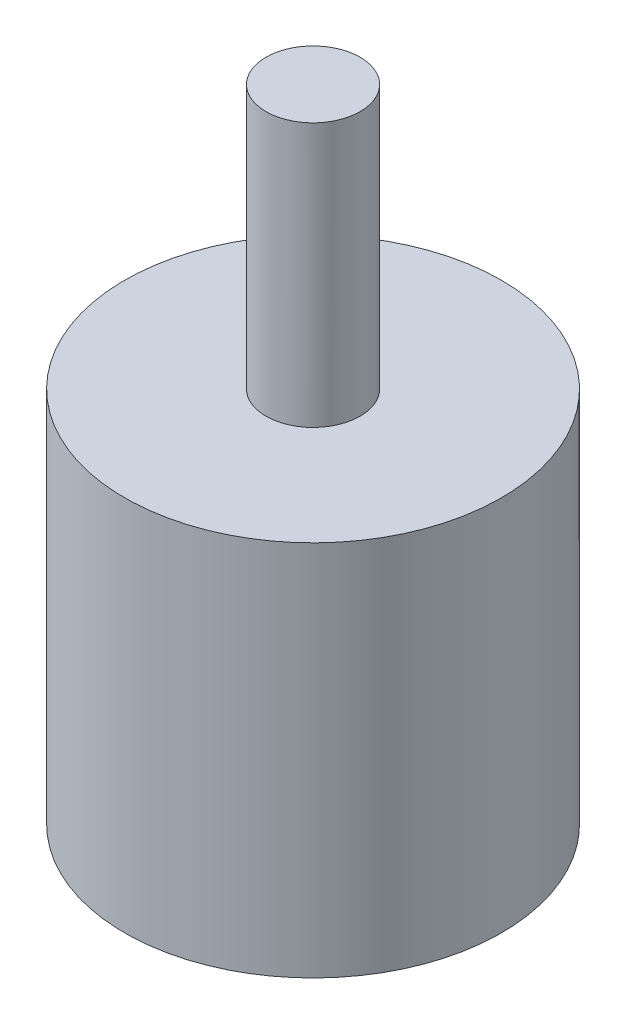
ISO-10303-21;
HEADER;
FILE_DESCRIPTION(('STEP AP214'),'2;1');
FILE_NAME('part.step','',(''),(''),'','','');
FILE_SCHEMA(('AUTOMOTIVE_DESIGN { 1 0 10303 214 1 1 1 1 }'));
ENDSEC;
DATA;
#1=APPLICATION_CONTEXT('core data for automotive mechanical design processes');
#2=APPLICATION_PROTOCOL_DEFINITION('international standard','automotive_design',2000,#1);
#3=PRODUCT_CONTEXT('',#1,'mechanical');
#4=PRODUCT('Part','Part','',(#3));
#5=PRODUCT_RELATED_PRODUCT_CATEGORY('part','',(#4));
#6=PRODUCT_DEFINITION_FORMATION('','',#4);
#7=PRODUCT_DEFINITION_CONTEXT('part definition',#1,'design');
#8=PRODUCT_DEFINITION('design','',#6,#7);
#9=PRODUCT_DEFINITION_SHAPE('','',#8);
#10=(LENGTH_UNIT() NAMED_UNIT(*) SI_UNIT(.MILLI.,.METRE.));
#11=(NAMED_UNIT(*) PLANE_ANGLE_UNIT() SI_UNIT($,.RADIAN.));
#12=(NAMED_UNIT(*) SI_UNIT($,.STERADIAN.) SOLID_ANGLE_UNIT());
#13=UNCERTAINTY_MEASURE_WITH_UNIT(LENGTH_MEASURE(1.E-05),#10,'distance_accuracy_value','');
#14=(GEOMETRIC_REPRESENTATION_CONTEXT(3) GLOBAL_UNCERTAINTY_ASSIGNED_CONTEXT((#13)) GLOBAL_UNIT_ASSIGNED_CONTEXT((#10,
#11,#12)) REPRESENTATION_CONTEXT('',''));
#15=CARTESIAN_POINT('',(0.,0.,0.));
#16=DIRECTION('',(0.,0.,1.));
#17=DIRECTION('',(1.,0.,0.));
#18=AXIS2_PLACEMENT_3D('',#15,#16,#17);
#19=CARTESIAN_POINT('',(0.,17.78,0.));
#20=DIRECTION('',(0.,-1.,0.));
#21=DIRECTION('',(0.,0.,-1.));
#22=AXIS2_PLACEMENT_3D('',#19,#20,#21);
#23=CYLINDRICAL_SURFACE('',#22,3.175);
#24=CARTESIAN_POINT('',(0.,17.78,0.));
#25=DIRECTION('',(0.,1.,0.));
#26=DIRECTION('',(0.,0.,1.));
#27=AXIS2_PLACEMENT_3D('',#24,#25,#26);
#28=CIRCLE('',#27,3.175);
#29=CARTESIAN_POINT('',(0.,17.78,3.175));
#30=VERTEX_POINT('',#29);
#31=EDGE_CURVE('E10',#30,#30,#28,.T.);
#32=ORIENTED_EDGE('',*,*,#31,.F.);
#33=EDGE_LOOP('',(#32));
#34=FACE_BOUND('',#33,.T.);
#35=CARTESIAN_POINT('',(0.,0.,0.));
#36=DIRECTION('',(0.,-1.,0.));
#37=DIRECTION('',(0.,0.,-1.));
#38=AXIS2_PLACEMENT_3D('',#35,#36,#37);
#39=CIRCLE('',#38,3.175);
#40=CARTESIAN_POINT('',(0.,0.,-3.175));
#41=VERTEX_POINT('',#40);
#42=EDGE_CURVE('E37',#41,#41,#39,.T.);
#43=ORIENTED_EDGE('',*,*,#42,.F.);
#44=EDGE_LOOP('',(#43));
#45=FACE_BOUND('',#44,.T.);
#46=ADVANCED_FACE('F31',(#34,#45),#23,.T.);
#47=CARTESIAN_POINT('',(0.,17.78,0.));
#48=DIRECTION('',(0.,1.,0.));
#49=DIRECTION('',(0.,0.,1.));
#50=AXIS2_PLACEMENT_3D('',#47,#48,#49);
#51=PLANE('',#50);
#52=ORIENTED_EDGE('',*,*,#31,.T.);
#53=EDGE_LOOP('',(#52));
#54=FACE_BOUND('',#53,.T.);
#55=ADVANCED_FACE('F64',(#54),#51,.T.);
#56=CARTESIAN_POINT('',(0.,-25.4,0.));
#57=DIRECTION('',(0.,1.,0.));
#58=DIRECTION('',(0.,0.,1.));
#59=AXIS2_PLACEMENT_3D('',#56,#57,#58);
#60=CYLINDRICAL_SURFACE('',#59,12.7);
#61=CARTESIAN_POINT('',(0.,-25.4,0.));
#62=DIRECTION('',(0.,-1.,0.));
#63=DIRECTION('',(0.,0.,-1.));
#64=AXIS2_PLACEMENT_3D('',#61,#62,#63);
#65=CIRCLE('',#64,12.7);
#66=CARTESIAN_POINT('',(0.,-25.4,-12.7));
#67=VERTEX_POINT('',#66);
#68=EDGE_CURVE('E41',#67,#67,#65,.T.);
#69=ORIENTED_EDGE('',*,*,#68,.F.);
#70=EDGE_LOOP('',(#69));
#71=FACE_BOUND('',#70,.T.);
#72=CARTESIAN_POINT('',(0.,0.,0.));
#73=DIRECTION('',(0.,-1.,0.));
#74=DIRECTION('',(0.,0.,-1.));
#75=AXIS2_PLACEMENT_3D('',#72,#73,#74);
#76=CIRCLE('',#75,12.7);
#77=CARTESIAN_POINT('',(0.,0.,-12.7));
#78=VERTEX_POINT('',#77);
#79=EDGE_CURVE('E45',#78,#78,#76,.T.);
#80=ORIENTED_EDGE('',*,*,#79,.T.);
#81=EDGE_LOOP('',(#80));
#82=FACE_BOUND('',#81,.T.);
#83=ADVANCED_FACE('F51',(#71,#82),#60,.T.);
#84=CARTESIAN_POINT('',(0.,-25.4,0.));
#85=DIRECTION('',(0.,-1.,0.));
#86=DIRECTION('',(0.,0.,-1.));
#87=AXIS2_PLACEMENT_3D('',#84,#85,#86);
#88=PLANE('',#87);
#89=ORIENTED_EDGE('',*,*,#68,.T.);
#90=EDGE_LOOP('',(#89));
#91=FACE_BOUND('',#90,.T.);
#92=ADVANCED_FACE('F55',(#91),#88,.T.);
#93=CARTESIAN_POINT('',(0.,0.,0.));
#94=DIRECTION('',(0.,-1.,0.));
#95=DIRECTION('',(0.,0.,-1.));
#96=AXIS2_PLACEMENT_3D('',#93,#94,#95);
#97=PLANE('',#96);
#98=ORIENTED_EDGE('',*,*,#42,.T.);
#99=EDGE_LOOP('',(#98));
#100=FACE_BOUND('',#99,.T.);
#101=ORIENTED_EDGE('',*,*,#79,.F.);
#102=EDGE_LOOP('',(#101));
#103=FACE_BOUND('',#102,.T.);
#104=ADVANCED_FACE('F53',(#100,#103),#97,.F.);
#105=CLOSED_SHELL('',(#46,#55,#83,#92,#104));
#106=MANIFOLD_SOLID_BREP('B2',#105);
#107=ADVANCED_BREP_SHAPE_REPRESENTATION('',(#18,#106),#14);
#108=SHAPE_DEFINITION_REPRESENTATION(#9,#107);
ENDSEC;
END-ISO-10303-21;
